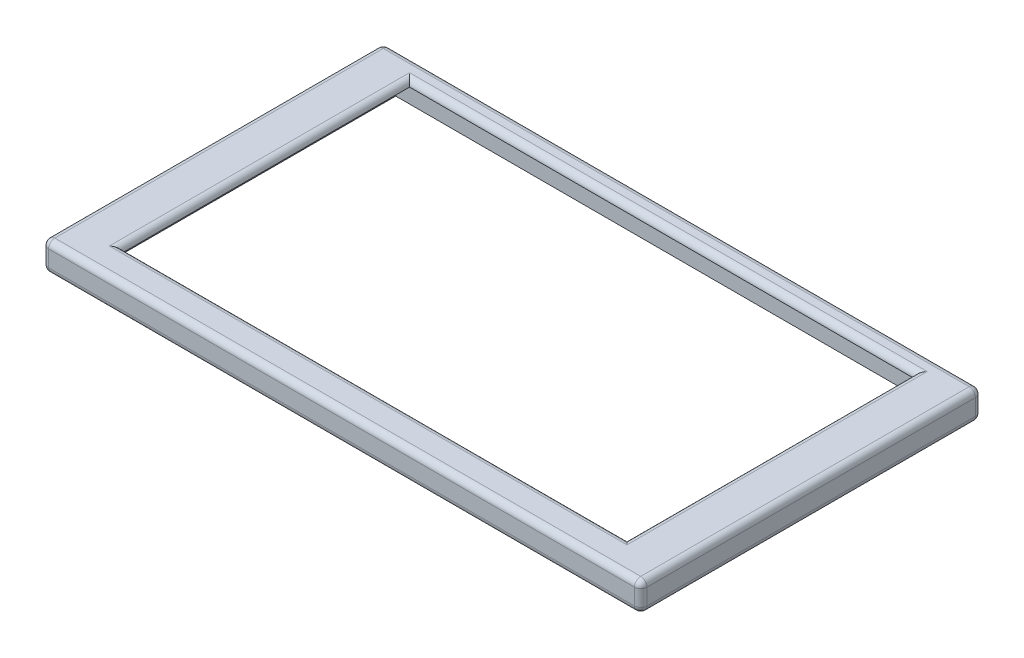
ISO-10303-21;
HEADER;
FILE_DESCRIPTION(('STEP AP214'),'2;1');
FILE_NAME('part.step','',(''),(''),'','','');
FILE_SCHEMA(('AUTOMOTIVE_DESIGN { 1 0 10303 214 1 1 1 1 }'));
ENDSEC;
DATA;
#1=APPLICATION_CONTEXT('core data for automotive mechanical design processes');
#2=APPLICATION_PROTOCOL_DEFINITION('international standard','automotive_design',2000,#1);
#3=PRODUCT_CONTEXT('',#1,'mechanical');
#4=PRODUCT('Part','Part','',(#3));
#5=PRODUCT_RELATED_PRODUCT_CATEGORY('part','',(#4));
#6=PRODUCT_DEFINITION_FORMATION('','',#4);
#7=PRODUCT_DEFINITION_CONTEXT('part definition',#1,'design');
#8=PRODUCT_DEFINITION('design','',#6,#7);
#9=PRODUCT_DEFINITION_SHAPE('','',#8);
#10=(LENGTH_UNIT() NAMED_UNIT(*) SI_UNIT(.MILLI.,.METRE.));
#11=(NAMED_UNIT(*) PLANE_ANGLE_UNIT() SI_UNIT($,.RADIAN.));
#12=(NAMED_UNIT(*) SI_UNIT($,.STERADIAN.) SOLID_ANGLE_UNIT());
#13=UNCERTAINTY_MEASURE_WITH_UNIT(LENGTH_MEASURE(1.E-05),#10,'distance_accuracy_value','');
#14=(GEOMETRIC_REPRESENTATION_CONTEXT(3) GLOBAL_UNCERTAINTY_ASSIGNED_CONTEXT((#13)) GLOBAL_UNIT_ASSIGNED_CONTEXT((#10,
#11,#12)) REPRESENTATION_CONTEXT('',''));
#15=CARTESIAN_POINT('',(0.,0.,0.));
#16=DIRECTION('',(0.,0.,1.));
#17=DIRECTION('',(1.,0.,0.));
#18=AXIS2_PLACEMENT_3D('',#15,#16,#17);
#19=CARTESIAN_POINT('',(0.,9.2,0.));
#20=DIRECTION('',(0.,-1.,0.));
#21=DIRECTION('',(0.,0.,-1.));
#22=AXIS2_PLACEMENT_3D('',#19,#20,#21);
#23=PLANE('',#22);
#24=DIRECTION('',(1.,0.,0.));
#25=VECTOR('',#24,1.);
#26=CARTESIAN_POINT('',(14.9,9.2,-8.5));
#27=LINE('',#26,#25);
#28=CARTESIAN_POINT('',(178.4,9.2,-8.5));
#29=VERTEX_POINT('',#28);
#30=CARTESIAN_POINT('',(12.9,9.2,-8.5));
#31=VERTEX_POINT('',#30);
#32=EDGE_CURVE('E44',#29,#31,#27,.F.);
#33=ORIENTED_EDGE('',*,*,#32,.T.);
#34=DIRECTION('',(0.,0.,1.));
#35=VECTOR('',#34,1.);
#36=CARTESIAN_POINT('',(12.9,9.2,-102.5));
#37=LINE('',#36,#35);
#38=CARTESIAN_POINT('',(12.9,9.2,-104.5));
#39=VERTEX_POINT('',#38);
#40=EDGE_CURVE('E12',#31,#39,#37,.F.);
#41=ORIENTED_EDGE('',*,*,#40,.T.);
#42=DIRECTION('',(-1.,0.,0.));
#43=VECTOR('',#42,1.);
#44=CARTESIAN_POINT('',(176.4,9.2,-104.5));
#45=LINE('',#44,#43);
#46=CARTESIAN_POINT('',(178.4,9.2,-104.5));
#47=VERTEX_POINT('',#46);
#48=EDGE_CURVE('E339',#39,#47,#45,.F.);
#49=ORIENTED_EDGE('',*,*,#48,.T.);
#50=DIRECTION('',(0.,0.,-1.));
#51=VECTOR('',#50,1.);
#52=CARTESIAN_POINT('',(178.4,9.2,-10.5));
#53=LINE('',#52,#51);
#54=EDGE_CURVE('E55',#47,#29,#53,.F.);
#55=ORIENTED_EDGE('',*,*,#54,.T.);
#56=EDGE_LOOP('',(#33,#41,#49,#55));
#57=FACE_BOUND('',#56,.T.);
#58=DIRECTION('',(0.,0.,-1.));
#59=VECTOR('',#58,1.);
#60=CARTESIAN_POINT('',(189.3,9.2,0.));
#61=LINE('',#60,#59);
#62=CARTESIAN_POINT('',(189.3,9.2,-2.));
#63=VERTEX_POINT('',#62);
#64=CARTESIAN_POINT('',(189.3,9.2,-107.));
#65=VERTEX_POINT('',#64);
#66=EDGE_CURVE('E334',#63,#65,#61,.T.);
#67=ORIENTED_EDGE('',*,*,#66,.T.);
#68=DIRECTION('',(-1.,0.,0.));
#69=VECTOR('',#68,1.);
#70=CARTESIAN_POINT('',(0.,9.2,-107.));
#71=LINE('',#70,#69);
#72=CARTESIAN_POINT('',(2.,9.2,-107.));
#73=VERTEX_POINT('',#72);
#74=EDGE_CURVE('E336',#65,#73,#71,.T.);
#75=ORIENTED_EDGE('',*,*,#74,.T.);
#76=DIRECTION('',(0.,0.,1.));
#77=VECTOR('',#76,1.);
#78=CARTESIAN_POINT('',(2.,9.2,0.));
#79=LINE('',#78,#77);
#80=CARTESIAN_POINT('',(2.,9.2,-2.));
#81=VERTEX_POINT('',#80);
#82=EDGE_CURVE('E330',#73,#81,#79,.T.);
#83=ORIENTED_EDGE('',*,*,#82,.T.);
#84=DIRECTION('',(1.,0.,0.));
#85=VECTOR('',#84,1.);
#86=CARTESIAN_POINT('',(0.,9.2,-2.));
#87=LINE('',#86,#85);
#88=EDGE_CURVE('E332',#81,#63,#87,.T.);
#89=ORIENTED_EDGE('',*,*,#88,.T.);
#90=EDGE_LOOP('',(#67,#75,#83,#89));
#91=FACE_BOUND('',#90,.T.);
#92=ADVANCED_FACE('F35',(#57,#91),#23,.F.);
#93=CARTESIAN_POINT('',(0.,0.,0.));
#94=DIRECTION('',(0.,-1.,0.));
#95=DIRECTION('',(0.,0.,-1.));
#96=AXIS2_PLACEMENT_3D('',#93,#94,#95);
#97=PLANE('',#96);
#98=DIRECTION('',(1.,0.,0.));
#99=VECTOR('',#98,1.);
#100=CARTESIAN_POINT('',(0.,0.,-2.));
#101=LINE('',#100,#99);
#102=CARTESIAN_POINT('',(189.3,0.,-2.));
#103=VERTEX_POINT('',#102);
#104=CARTESIAN_POINT('',(2.,0.,-2.));
#105=VERTEX_POINT('',#104);
#106=EDGE_CURVE('E292',#103,#105,#101,.F.);
#107=ORIENTED_EDGE('',*,*,#106,.T.);
#108=DIRECTION('',(0.,0.,1.));
#109=VECTOR('',#108,1.);
#110=CARTESIAN_POINT('',(2.,0.,-109.));
#111=LINE('',#110,#109);
#112=CARTESIAN_POINT('',(2.,0.,-28.));
#113=VERTEX_POINT('',#112);
#114=EDGE_CURVE('E300',#105,#113,#111,.F.);
#115=ORIENTED_EDGE('',*,*,#114,.T.);
#116=DIRECTION('',(-1.,0.,0.));
#117=VECTOR('',#116,1.);
#118=CARTESIAN_POINT('',(2.,0.,-28.));
#119=LINE('',#118,#117);
#120=CARTESIAN_POINT('',(6.,0.,-28.));
#121=VERTEX_POINT('',#120);
#122=EDGE_CURVE('E220',#121,#113,#119,.T.);
#123=ORIENTED_EDGE('',*,*,#122,.F.);
#124=DIRECTION('',(0.,0.,1.));
#125=VECTOR('',#124,1.);
#126=CARTESIAN_POINT('',(6.,0.,-81.));
#127=LINE('',#126,#125);
#128=CARTESIAN_POINT('',(6.,0.,-81.));
#129=VERTEX_POINT('',#128);
#130=EDGE_CURVE('E223',#129,#121,#127,.T.);
#131=ORIENTED_EDGE('',*,*,#130,.F.);
#132=DIRECTION('',(1.,0.,0.));
#133=VECTOR('',#132,1.);
#134=CARTESIAN_POINT('',(2.,0.,-81.));
#135=LINE('',#134,#133);
#136=CARTESIAN_POINT('',(2.,0.,-81.));
#137=VERTEX_POINT('',#136);
#138=EDGE_CURVE('E229',#137,#129,#135,.T.);
#139=ORIENTED_EDGE('',*,*,#138,.F.);
#140=DIRECTION('',(0.,0.,1.));
#141=VECTOR('',#140,1.);
#142=CARTESIAN_POINT('',(2.,0.,-109.));
#143=LINE('',#142,#141);
#144=CARTESIAN_POINT('',(2.,0.,-107.));
#145=VERTEX_POINT('',#144);
#146=EDGE_CURVE('E298',#137,#145,#143,.F.);
#147=ORIENTED_EDGE('',*,*,#146,.T.);
#148=DIRECTION('',(-1.,0.,0.));
#149=VECTOR('',#148,1.);
#150=CARTESIAN_POINT('',(191.3,0.,-107.));
#151=LINE('',#150,#149);
#152=CARTESIAN_POINT('',(189.3,0.,-107.));
#153=VERTEX_POINT('',#152);
#154=EDGE_CURVE('E296',#145,#153,#151,.F.);
#155=ORIENTED_EDGE('',*,*,#154,.T.);
#156=DIRECTION('',(0.,0.,-1.));
#157=VECTOR('',#156,1.);
#158=CARTESIAN_POINT('',(189.3,0.,0.));
#159=LINE('',#158,#157);
#160=EDGE_CURVE('E294',#153,#103,#159,.F.);
#161=ORIENTED_EDGE('',*,*,#160,.T.);
#162=EDGE_LOOP('',(#107,#115,#123,#131,#139,#147,#155,#161));
#163=FACE_BOUND('',#162,.T.);
#164=DIRECTION('',(0.,0.,-1.));
#165=VECTOR('',#164,1.);
#166=CARTESIAN_POINT('',(8.,0.,-105.));
#167=LINE('',#166,#165);
#168=CARTESIAN_POINT('',(8.,0.,-4.));
#169=VERTEX_POINT('',#168);
#170=CARTESIAN_POINT('',(8.,0.,-105.));
#171=VERTEX_POINT('',#170);
#172=EDGE_CURVE('E251',#169,#171,#167,.T.);
#173=ORIENTED_EDGE('',*,*,#172,.F.);
#174=DIRECTION('',(-1.,0.,0.));
#175=VECTOR('',#174,1.);
#176=CARTESIAN_POINT('',(8.,0.,-4.));
#177=LINE('',#176,#175);
#178=CARTESIAN_POINT('',(183.3,0.,-4.));
#179=VERTEX_POINT('',#178);
#180=EDGE_CURVE('E256',#179,#169,#177,.T.);
#181=ORIENTED_EDGE('',*,*,#180,.F.);
#182=DIRECTION('',(0.,0.,1.));
#183=VECTOR('',#182,1.);
#184=CARTESIAN_POINT('',(183.3,0.,-4.));
#185=LINE('',#184,#183);
#186=CARTESIAN_POINT('',(183.3,0.,-105.));
#187=VERTEX_POINT('',#186);
#188=EDGE_CURVE('E270',#187,#179,#185,.T.);
#189=ORIENTED_EDGE('',*,*,#188,.F.);
#190=DIRECTION('',(1.,0.,0.));
#191=VECTOR('',#190,1.);
#192=CARTESIAN_POINT('',(183.3,0.,-105.));
#193=LINE('',#192,#191);
#194=EDGE_CURVE('E267',#171,#187,#193,.T.);
#195=ORIENTED_EDGE('',*,*,#194,.F.);
#196=EDGE_LOOP('',(#173,#181,#189,#195));
#197=FACE_BOUND('',#196,.T.);
#198=ADVANCED_FACE('F429',(#163,#197),#97,.T.);
#199=CARTESIAN_POINT('',(0.,9.2,0.));
#200=DIRECTION('',(1.,0.,0.));
#201=DIRECTION('',(0.,0.,-1.));
#202=AXIS2_PLACEMENT_3D('',#199,#200,#201);
#203=PLANE('',#202);
#204=DIRECTION('',(0.,-1.,0.));
#205=VECTOR('',#204,1.);
#206=CARTESIAN_POINT('',(0.,9.2,-107.));
#207=LINE('',#206,#205);
#208=CARTESIAN_POINT('',(0.,7.2,-107.));
#209=VERTEX_POINT('',#208);
#210=CARTESIAN_POINT('',(0.,2.,-107.));
#211=VERTEX_POINT('',#210);
#212=EDGE_CURVE('E287',#209,#211,#207,.T.);
#213=ORIENTED_EDGE('',*,*,#212,.T.);
#214=DIRECTION('',(0.,0.,1.));
#215=VECTOR('',#214,1.);
#216=CARTESIAN_POINT('',(0.,2.,0.));
#217=LINE('',#216,#215);
#218=CARTESIAN_POINT('',(0.,2.,-2.));
#219=VERTEX_POINT('',#218);
#220=EDGE_CURVE('E289',#211,#219,#217,.T.);
#221=ORIENTED_EDGE('',*,*,#220,.T.);
#222=DIRECTION('',(0.,-1.,0.));
#223=VECTOR('',#222,1.);
#224=CARTESIAN_POINT('',(0.,9.2,-2.));
#225=LINE('',#224,#223);
#226=CARTESIAN_POINT('',(0.,7.2,-2.));
#227=VERTEX_POINT('',#226);
#228=EDGE_CURVE('E285',#219,#227,#225,.F.);
#229=ORIENTED_EDGE('',*,*,#228,.T.);
#230=DIRECTION('',(0.,0.,1.));
#231=VECTOR('',#230,1.);
#232=CARTESIAN_POINT('',(0.,7.2,0.));
#233=LINE('',#232,#231);
#234=EDGE_CURVE('E277',#227,#209,#233,.F.);
#235=ORIENTED_EDGE('',*,*,#234,.T.);
#236=EDGE_LOOP('',(#213,#221,#229,#235));
#237=FACE_BOUND('',#236,.T.);
#238=ADVANCED_FACE('F508',(#237),#203,.F.);
#239=CARTESIAN_POINT('',(0.,9.2,0.));
#240=DIRECTION('',(0.,0.,-1.));
#241=DIRECTION('',(-1.,0.,0.));
#242=AXIS2_PLACEMENT_3D('',#239,#240,#241);
#243=PLANE('',#242);
#244=DIRECTION('',(0.,-1.,0.));
#245=VECTOR('',#244,1.);
#246=CARTESIAN_POINT('',(2.,9.2,0.));
#247=LINE('',#246,#245);
#248=CARTESIAN_POINT('',(2.,7.2,0.));
#249=VERTEX_POINT('',#248);
#250=CARTESIAN_POINT('',(2.,2.,0.));
#251=VERTEX_POINT('',#250);
#252=EDGE_CURVE('E325',#249,#251,#247,.T.);
#253=ORIENTED_EDGE('',*,*,#252,.T.);
#254=DIRECTION('',(1.,0.,0.));
#255=VECTOR('',#254,1.);
#256=CARTESIAN_POINT('',(191.3,2.,0.));
#257=LINE('',#256,#255);
#258=CARTESIAN_POINT('',(189.3,2.,0.));
#259=VERTEX_POINT('',#258);
#260=EDGE_CURVE('E328',#251,#259,#257,.T.);
#261=ORIENTED_EDGE('',*,*,#260,.T.);
#262=DIRECTION('',(0.,-1.,0.));
#263=VECTOR('',#262,1.);
#264=CARTESIAN_POINT('',(189.3,9.2,0.));
#265=LINE('',#264,#263);
#266=CARTESIAN_POINT('',(189.3,7.2,0.));
#267=VERTEX_POINT('',#266);
#268=EDGE_CURVE('E323',#259,#267,#265,.F.);
#269=ORIENTED_EDGE('',*,*,#268,.T.);
#270=DIRECTION('',(1.,0.,0.));
#271=VECTOR('',#270,1.);
#272=CARTESIAN_POINT('',(0.,7.2,0.));
#273=LINE('',#272,#271);
#274=EDGE_CURVE('E321',#267,#249,#273,.F.);
#275=ORIENTED_EDGE('',*,*,#274,.T.);
#276=EDGE_LOOP('',(#253,#261,#269,#275));
#277=FACE_BOUND('',#276,.T.);
#278=ADVANCED_FACE('F518',(#277),#243,.F.);
#279=CARTESIAN_POINT('',(191.3,9.2,0.));
#280=DIRECTION('',(-1.,0.,0.));
#281=DIRECTION('',(0.,0.,1.));
#282=AXIS2_PLACEMENT_3D('',#279,#280,#281);
#283=PLANE('',#282);
#284=DIRECTION('',(0.,0.,-1.));
#285=VECTOR('',#284,1.);
#286=CARTESIAN_POINT('',(191.3,2.,-109.));
#287=LINE('',#286,#285);
#288=CARTESIAN_POINT('',(191.3,2.,-2.));
#289=VERTEX_POINT('',#288);
#290=CARTESIAN_POINT('',(191.3,2.,-107.));
#291=VERTEX_POINT('',#290);
#292=EDGE_CURVE('E316',#289,#291,#287,.T.);
#293=ORIENTED_EDGE('',*,*,#292,.T.);
#294=DIRECTION('',(0.,-1.,0.));
#295=VECTOR('',#294,1.);
#296=CARTESIAN_POINT('',(191.3,9.2,-107.));
#297=LINE('',#296,#295);
#298=CARTESIAN_POINT('',(191.3,7.2,-107.));
#299=VERTEX_POINT('',#298);
#300=EDGE_CURVE('E318',#291,#299,#297,.F.);
#301=ORIENTED_EDGE('',*,*,#300,.T.);
#302=DIRECTION('',(0.,0.,-1.));
#303=VECTOR('',#302,1.);
#304=CARTESIAN_POINT('',(191.3,7.2,0.));
#305=LINE('',#304,#303);
#306=CARTESIAN_POINT('',(191.3,7.2,-2.));
#307=VERTEX_POINT('',#306);
#308=EDGE_CURVE('E312',#299,#307,#305,.F.);
#309=ORIENTED_EDGE('',*,*,#308,.T.);
#310=DIRECTION('',(0.,-1.,0.));
#311=VECTOR('',#310,1.);
#312=CARTESIAN_POINT('',(191.3,9.2,-2.));
#313=LINE('',#312,#311);
#314=EDGE_CURVE('E314',#307,#289,#313,.T.);
#315=ORIENTED_EDGE('',*,*,#314,.T.);
#316=EDGE_LOOP('',(#293,#301,#309,#315));
#317=FACE_BOUND('',#316,.T.);
#318=ADVANCED_FACE('F472',(#317),#283,.F.);
#319=CARTESIAN_POINT('',(0.,9.2,-109.));
#320=DIRECTION('',(0.,0.,1.));
#321=DIRECTION('',(1.,0.,0.));
#322=AXIS2_PLACEMENT_3D('',#319,#320,#321);
#323=PLANE('',#322);
#324=DIRECTION('',(-1.,0.,0.));
#325=VECTOR('',#324,1.);
#326=CARTESIAN_POINT('',(0.,2.,-109.));
#327=LINE('',#326,#325);
#328=CARTESIAN_POINT('',(189.3,2.,-109.));
#329=VERTEX_POINT('',#328);
#330=CARTESIAN_POINT('',(2.,2.,-109.));
#331=VERTEX_POINT('',#330);
#332=EDGE_CURVE('E307',#329,#331,#327,.T.);
#333=ORIENTED_EDGE('',*,*,#332,.T.);
#334=DIRECTION('',(0.,-1.,0.));
#335=VECTOR('',#334,1.);
#336=CARTESIAN_POINT('',(2.,9.2,-109.));
#337=LINE('',#336,#335);
#338=CARTESIAN_POINT('',(2.,7.2,-109.));
#339=VERTEX_POINT('',#338);
#340=EDGE_CURVE('E309',#331,#339,#337,.F.);
#341=ORIENTED_EDGE('',*,*,#340,.T.);
#342=DIRECTION('',(-1.,0.,0.));
#343=VECTOR('',#342,1.);
#344=CARTESIAN_POINT('',(0.,7.2,-109.));
#345=LINE('',#344,#343);
#346=CARTESIAN_POINT('',(189.3,7.2,-109.));
#347=VERTEX_POINT('',#346);
#348=EDGE_CURVE('E303',#339,#347,#345,.F.);
#349=ORIENTED_EDGE('',*,*,#348,.T.);
#350=DIRECTION('',(0.,-1.,0.));
#351=VECTOR('',#350,1.);
#352=CARTESIAN_POINT('',(189.3,9.2,-109.));
#353=LINE('',#352,#351);
#354=EDGE_CURVE('E305',#347,#329,#353,.T.);
#355=ORIENTED_EDGE('',*,*,#354,.T.);
#356=EDGE_LOOP('',(#333,#341,#349,#355));
#357=FACE_BOUND('',#356,.T.);
#358=ADVANCED_FACE('F488',(#357),#323,.F.);
#359=CARTESIAN_POINT('',(8.,7.2,-105.));
#360=DIRECTION('',(-1.,0.,0.));
#361=DIRECTION('',(0.,0.,1.));
#362=AXIS2_PLACEMENT_3D('',#359,#360,#361);
#363=PLANE('',#362);
#364=ORIENTED_EDGE('',*,*,#172,.T.);
#365=DIRECTION('',(0.,-1.,0.));
#366=VECTOR('',#365,1.);
#367=CARTESIAN_POINT('',(8.,7.2,-105.));
#368=LINE('',#367,#366);
#369=CARTESIAN_POINT('',(8.,7.2,-105.));
#370=VERTEX_POINT('',#369);
#371=EDGE_CURVE('E265',#370,#171,#368,.T.);
#372=ORIENTED_EDGE('',*,*,#371,.F.);
#373=DIRECTION('',(0.,0.,-1.));
#374=VECTOR('',#373,1.);
#375=CARTESIAN_POINT('',(8.,7.2,-105.));
#376=LINE('',#375,#374);
#377=CARTESIAN_POINT('',(8.,7.2,-4.));
#378=VERTEX_POINT('',#377);
#379=EDGE_CURVE('E252',#378,#370,#376,.T.);
#380=ORIENTED_EDGE('',*,*,#379,.F.);
#381=DIRECTION('',(0.,-1.,0.));
#382=VECTOR('',#381,1.);
#383=CARTESIAN_POINT('',(8.,7.2,-4.));
#384=LINE('',#383,#382);
#385=EDGE_CURVE('E275',#378,#169,#384,.T.);
#386=ORIENTED_EDGE('',*,*,#385,.T.);
#387=EDGE_LOOP('',(#364,#372,#380,#386));
#388=FACE_BOUND('',#387,.T.);
#389=ADVANCED_FACE('F754',(#388),#363,.F.);
#390=CARTESIAN_POINT('',(8.,7.2,-4.));
#391=DIRECTION('',(0.,0.,1.));
#392=DIRECTION('',(1.,0.,0.));
#393=AXIS2_PLACEMENT_3D('',#390,#391,#392);
#394=PLANE('',#393);
#395=ORIENTED_EDGE('',*,*,#180,.T.);
#396=ORIENTED_EDGE('',*,*,#385,.F.);
#397=DIRECTION('',(-1.,0.,0.));
#398=VECTOR('',#397,1.);
#399=CARTESIAN_POINT('',(8.,7.2,-4.));
#400=LINE('',#399,#398);
#401=CARTESIAN_POINT('',(183.3,7.2,-4.));
#402=VERTEX_POINT('',#401);
#403=EDGE_CURVE('E262',#402,#378,#400,.T.);
#404=ORIENTED_EDGE('',*,*,#403,.F.);
#405=DIRECTION('',(0.,-1.,0.));
#406=VECTOR('',#405,1.);
#407=CARTESIAN_POINT('',(183.3,7.2,-4.));
#408=LINE('',#407,#406);
#409=EDGE_CURVE('E278',#402,#179,#408,.T.);
#410=ORIENTED_EDGE('',*,*,#409,.T.);
#411=EDGE_LOOP('',(#395,#396,#404,#410));
#412=FACE_BOUND('',#411,.T.);
#413=ADVANCED_FACE('F823',(#412),#394,.F.);
#414=CARTESIAN_POINT('',(183.3,7.2,-4.));
#415=DIRECTION('',(1.,0.,0.));
#416=DIRECTION('',(0.,0.,-1.));
#417=AXIS2_PLACEMENT_3D('',#414,#415,#416);
#418=PLANE('',#417);
#419=ORIENTED_EDGE('',*,*,#188,.T.);
#420=ORIENTED_EDGE('',*,*,#409,.F.);
#421=DIRECTION('',(0.,0.,1.));
#422=VECTOR('',#421,1.);
#423=CARTESIAN_POINT('',(183.3,7.2,-4.));
#424=LINE('',#423,#422);
#425=CARTESIAN_POINT('',(183.3,7.2,-105.));
#426=VERTEX_POINT('',#425);
#427=EDGE_CURVE('E259',#426,#402,#424,.T.);
#428=ORIENTED_EDGE('',*,*,#427,.F.);
#429=DIRECTION('',(0.,-1.,0.));
#430=VECTOR('',#429,1.);
#431=CARTESIAN_POINT('',(183.3,7.2,-105.));
#432=LINE('',#431,#430);
#433=EDGE_CURVE('E280',#426,#187,#432,.T.);
#434=ORIENTED_EDGE('',*,*,#433,.T.);
#435=EDGE_LOOP('',(#419,#420,#428,#434));
#436=FACE_BOUND('',#435,.T.);
#437=ADVANCED_FACE('F813',(#436),#418,.F.);
#438=CARTESIAN_POINT('',(183.3,7.2,-105.));
#439=DIRECTION('',(0.,0.,-1.));
#440=DIRECTION('',(-1.,0.,0.));
#441=AXIS2_PLACEMENT_3D('',#438,#439,#440);
#442=PLANE('',#441);
#443=ORIENTED_EDGE('',*,*,#194,.T.);
#444=ORIENTED_EDGE('',*,*,#433,.F.);
#445=DIRECTION('',(1.,0.,0.));
#446=VECTOR('',#445,1.);
#447=CARTESIAN_POINT('',(183.3,7.2,-105.));
#448=LINE('',#447,#446);
#449=EDGE_CURVE('E255',#370,#426,#448,.T.);
#450=ORIENTED_EDGE('',*,*,#449,.F.);
#451=ORIENTED_EDGE('',*,*,#371,.T.);
#452=EDGE_LOOP('',(#443,#444,#450,#451));
#453=FACE_BOUND('',#452,.T.);
#454=ADVANCED_FACE('F742',(#453),#442,.F.);
#455=CARTESIAN_POINT('',(0.,7.2,0.));
#456=DIRECTION('',(0.,1.,0.));
#457=DIRECTION('',(0.,0.,1.));
#458=AXIS2_PLACEMENT_3D('',#455,#456,#457);
#459=PLANE('',#458);
#460=DIRECTION('',(0.,0.,-1.));
#461=VECTOR('',#460,1.);
#462=CARTESIAN_POINT('',(14.9,7.2,-10.5));
#463=LINE('',#462,#461);
#464=CARTESIAN_POINT('',(14.9,7.2,-10.5));
#465=VERTEX_POINT('',#464);
#466=CARTESIAN_POINT('',(14.9,7.2,-102.5));
#467=VERTEX_POINT('',#466);
#468=EDGE_CURVE('E236',#465,#467,#463,.T.);
#469=ORIENTED_EDGE('',*,*,#468,.F.);
#470=DIRECTION('',(-1.,0.,0.));
#471=VECTOR('',#470,1.);
#472=CARTESIAN_POINT('',(14.9,7.2,-10.5));
#473=LINE('',#472,#471);
#474=CARTESIAN_POINT('',(176.4,7.2,-10.5));
#475=VERTEX_POINT('',#474);
#476=EDGE_CURVE('E248',#475,#465,#473,.T.);
#477=ORIENTED_EDGE('',*,*,#476,.F.);
#478=DIRECTION('',(0.,0.,1.));
#479=VECTOR('',#478,1.);
#480=CARTESIAN_POINT('',(176.4,7.2,-10.5));
#481=LINE('',#480,#479);
#482=CARTESIAN_POINT('',(176.4,7.2,-102.5));
#483=VERTEX_POINT('',#482);
#484=EDGE_CURVE('E245',#483,#475,#481,.T.);
#485=ORIENTED_EDGE('',*,*,#484,.F.);
#486=DIRECTION('',(1.,0.,0.));
#487=VECTOR('',#486,1.);
#488=CARTESIAN_POINT('',(14.9,7.2,-102.5));
#489=LINE('',#488,#487);
#490=EDGE_CURVE('E242',#467,#483,#489,.T.);
#491=ORIENTED_EDGE('',*,*,#490,.F.);
#492=EDGE_LOOP('',(#469,#477,#485,#491));
#493=FACE_BOUND('',#492,.T.);
#494=ORIENTED_EDGE('',*,*,#379,.T.);
#495=ORIENTED_EDGE('',*,*,#449,.T.);
#496=ORIENTED_EDGE('',*,*,#427,.T.);
#497=ORIENTED_EDGE('',*,*,#403,.T.);
#498=EDGE_LOOP('',(#494,#495,#496,#497));
#499=FACE_BOUND('',#498,.T.);
#500=ADVANCED_FACE('F733',(#493,#499),#459,.F.);
#501=CARTESIAN_POINT('',(2.,3.,-81.));
#502=DIRECTION('',(-1.,0.,0.));
#503=DIRECTION('',(0.,0.,1.));
#504=AXIS2_PLACEMENT_3D('',#501,#502,#503);
#505=PLANE('',#504);
#506=DIRECTION('',(0.,0.,-1.));
#507=VECTOR('',#506,1.);
#508=CARTESIAN_POINT('',(2.,0.,-81.));
#509=LINE('',#508,#507);
#510=EDGE_CURVE('E203',#113,#137,#509,.T.);
#511=ORIENTED_EDGE('',*,*,#510,.T.);
#512=DIRECTION('',(0.,-1.,0.));
#513=VECTOR('',#512,1.);
#514=CARTESIAN_POINT('',(2.,3.,-81.));
#515=LINE('',#514,#513);
#516=CARTESIAN_POINT('',(2.,3.,-81.));
#517=VERTEX_POINT('',#516);
#518=EDGE_CURVE('E196',#517,#137,#515,.T.);
#519=ORIENTED_EDGE('',*,*,#518,.F.);
#520=DIRECTION('',(0.,0.,-1.));
#521=VECTOR('',#520,1.);
#522=CARTESIAN_POINT('',(2.,3.,-81.));
#523=LINE('',#522,#521);
#524=CARTESIAN_POINT('',(2.,3.,-28.));
#525=VERTEX_POINT('',#524);
#526=EDGE_CURVE('E201',#525,#517,#523,.T.);
#527=ORIENTED_EDGE('',*,*,#526,.F.);
#528=DIRECTION('',(0.,-1.,0.));
#529=VECTOR('',#528,1.);
#530=CARTESIAN_POINT('',(2.,3.,-28.));
#531=LINE('',#530,#529);
#532=EDGE_CURVE('E234',#525,#113,#531,.T.);
#533=ORIENTED_EDGE('',*,*,#532,.T.);
#534=EDGE_LOOP('',(#511,#519,#527,#533));
#535=FACE_BOUND('',#534,.T.);
#536=ADVANCED_FACE('F198',(#535),#505,.F.);
#537=CARTESIAN_POINT('',(2.,3.,-28.));
#538=DIRECTION('',(0.,0.,1.));
#539=DIRECTION('',(1.,0.,0.));
#540=AXIS2_PLACEMENT_3D('',#537,#538,#539);
#541=PLANE('',#540);
#542=ORIENTED_EDGE('',*,*,#122,.T.);
#543=ORIENTED_EDGE('',*,*,#532,.F.);
#544=DIRECTION('',(-1.,0.,0.));
#545=VECTOR('',#544,1.);
#546=CARTESIAN_POINT('',(2.,3.,-28.));
#547=LINE('',#546,#545);
#548=CARTESIAN_POINT('',(6.,3.,-28.));
#549=VERTEX_POINT('',#548);
#550=EDGE_CURVE('E208',#549,#525,#547,.T.);
#551=ORIENTED_EDGE('',*,*,#550,.F.);
#552=DIRECTION('',(0.,-1.,0.));
#553=VECTOR('',#552,1.);
#554=CARTESIAN_POINT('',(6.,3.,-28.));
#555=LINE('',#554,#553);
#556=EDGE_CURVE('E237',#549,#121,#555,.T.);
#557=ORIENTED_EDGE('',*,*,#556,.T.);
#558=EDGE_LOOP('',(#542,#543,#551,#557));
#559=FACE_BOUND('',#558,.T.);
#560=ADVANCED_FACE('F719',(#559),#541,.F.);
#561=CARTESIAN_POINT('',(6.,3.,-81.));
#562=DIRECTION('',(1.,0.,0.));
#563=DIRECTION('',(0.,0.,-1.));
#564=AXIS2_PLACEMENT_3D('',#561,#562,#563);
#565=PLANE('',#564);
#566=ORIENTED_EDGE('',*,*,#130,.T.);
#567=ORIENTED_EDGE('',*,*,#556,.F.);
#568=DIRECTION('',(0.,0.,1.));
#569=VECTOR('',#568,1.);
#570=CARTESIAN_POINT('',(6.,3.,-81.));
#571=LINE('',#570,#569);
#572=CARTESIAN_POINT('',(6.,3.,-81.));
#573=VERTEX_POINT('',#572);
#574=EDGE_CURVE('E216',#573,#549,#571,.T.);
#575=ORIENTED_EDGE('',*,*,#574,.F.);
#576=DIRECTION('',(0.,-1.,0.));
#577=VECTOR('',#576,1.);
#578=CARTESIAN_POINT('',(6.,3.,-81.));
#579=LINE('',#578,#577);
#580=EDGE_CURVE('E207',#573,#129,#579,.T.);
#581=ORIENTED_EDGE('',*,*,#580,.T.);
#582=EDGE_LOOP('',(#566,#567,#575,#581));
#583=FACE_BOUND('',#582,.T.);
#584=ADVANCED_FACE('F712',(#583),#565,.F.);
#585=CARTESIAN_POINT('',(2.,3.,-81.));
#586=DIRECTION('',(0.,0.,-1.));
#587=DIRECTION('',(-1.,0.,0.));
#588=AXIS2_PLACEMENT_3D('',#585,#586,#587);
#589=PLANE('',#588);
#590=ORIENTED_EDGE('',*,*,#138,.T.);
#591=ORIENTED_EDGE('',*,*,#580,.F.);
#592=DIRECTION('',(1.,0.,0.));
#593=VECTOR('',#592,1.);
#594=CARTESIAN_POINT('',(2.,3.,-81.));
#595=LINE('',#594,#593);
#596=EDGE_CURVE('E211',#517,#573,#595,.T.);
#597=ORIENTED_EDGE('',*,*,#596,.F.);
#598=ORIENTED_EDGE('',*,*,#518,.T.);
#599=EDGE_LOOP('',(#590,#591,#597,#598));
#600=FACE_BOUND('',#599,.T.);
#601=ADVANCED_FACE('F212',(#600),#589,.F.);
#602=CARTESIAN_POINT('',(0.,3.,0.));
#603=DIRECTION('',(0.,1.,0.));
#604=DIRECTION('',(0.,0.,1.));
#605=AXIS2_PLACEMENT_3D('',#602,#603,#604);
#606=PLANE('',#605);
#607=ORIENTED_EDGE('',*,*,#526,.T.);
#608=ORIENTED_EDGE('',*,*,#596,.T.);
#609=ORIENTED_EDGE('',*,*,#574,.T.);
#610=ORIENTED_EDGE('',*,*,#550,.T.);
#611=EDGE_LOOP('',(#607,#608,#609,#610));
#612=FACE_BOUND('',#611,.T.);
#613=ADVANCED_FACE('F218',(#612),#606,.F.);
#614=CARTESIAN_POINT('',(189.3,7.2,0.));
#615=DIRECTION('',(0.,0.,-1.));
#616=DIRECTION('',(-1.,0.,0.));
#617=AXIS2_PLACEMENT_3D('',#614,#615,#616);
#618=CYLINDRICAL_SURFACE('',#617,2.);
#619=CARTESIAN_POINT('',(189.3,7.2,-107.));
#620=DIRECTION('',(0.,0.,-1.));
#621=DIRECTION('',(-1.,0.,0.));
#622=AXIS2_PLACEMENT_3D('',#619,#620,#621);
#623=CIRCLE('',#622,2.);
#624=EDGE_CURVE('E230',#65,#299,#623,.T.);
#625=ORIENTED_EDGE('',*,*,#624,.F.);
#626=ORIENTED_EDGE('',*,*,#66,.F.);
#627=CARTESIAN_POINT('',(189.3,7.2,-2.));
#628=DIRECTION('',(0.,0.,1.));
#629=DIRECTION('',(1.,0.,0.));
#630=AXIS2_PLACEMENT_3D('',#627,#628,#629);
#631=CIRCLE('',#630,2.);
#632=EDGE_CURVE('E404',#307,#63,#631,.T.);
#633=ORIENTED_EDGE('',*,*,#632,.F.);
#634=ORIENTED_EDGE('',*,*,#308,.F.);
#635=EDGE_LOOP('',(#625,#626,#633,#634));
#636=FACE_BOUND('',#635,.T.);
#637=ADVANCED_FACE('F439',(#636),#618,.T.);
#638=CARTESIAN_POINT('',(189.3,7.2,-107.));
#639=DIRECTION('',(0.,0.,1.));
#640=DIRECTION('',(1.,0.,0.));
#641=AXIS2_PLACEMENT_3D('',#638,#639,#640);
#642=SPHERICAL_SURFACE('',#641,2.);
#643=CARTESIAN_POINT('',(189.3,7.2,-107.));
#644=DIRECTION('',(1.,0.,0.));
#645=DIRECTION('',(0.,0.,-1.));
#646=AXIS2_PLACEMENT_3D('',#643,#644,#645);
#647=CIRCLE('',#646,2.);
#648=EDGE_CURVE('E399',#65,#347,#647,.F.);
#649=ORIENTED_EDGE('',*,*,#648,.F.);
#650=ORIENTED_EDGE('',*,*,#624,.T.);
#651=CARTESIAN_POINT('',(189.3,7.2,-107.));
#652=DIRECTION('',(0.,1.,0.));
#653=DIRECTION('',(0.,0.,1.));
#654=AXIS2_PLACEMENT_3D('',#651,#652,#653);
#655=CIRCLE('',#654,2.);
#656=EDGE_CURVE('E402',#347,#299,#655,.F.);
#657=ORIENTED_EDGE('',*,*,#656,.F.);
#658=EDGE_LOOP('',(#649,#650,#657));
#659=FACE_BOUND('',#658,.T.);
#660=ADVANCED_FACE('F442',(#659),#642,.T.);
#661=CARTESIAN_POINT('',(189.3,7.2,-2.));
#662=DIRECTION('',(0.,0.,1.));
#663=DIRECTION('',(1.,0.,0.));
#664=AXIS2_PLACEMENT_3D('',#661,#662,#663);
#665=SPHERICAL_SURFACE('',#664,2.);
#666=CARTESIAN_POINT('',(189.3,7.2,-2.));
#667=DIRECTION('',(0.,1.,0.));
#668=DIRECTION('',(0.,0.,1.));
#669=AXIS2_PLACEMENT_3D('',#666,#667,#668);
#670=CIRCLE('',#669,2.);
#671=EDGE_CURVE('E393',#307,#267,#670,.F.);
#672=ORIENTED_EDGE('',*,*,#671,.F.);
#673=ORIENTED_EDGE('',*,*,#632,.T.);
#674=CARTESIAN_POINT('',(189.3,7.2,-2.));
#675=DIRECTION('',(1.,0.,0.));
#676=DIRECTION('',(0.,0.,-1.));
#677=AXIS2_PLACEMENT_3D('',#674,#675,#676);
#678=CIRCLE('',#677,2.);
#679=EDGE_CURVE('E396',#267,#63,#678,.F.);
#680=ORIENTED_EDGE('',*,*,#679,.F.);
#681=EDGE_LOOP('',(#672,#673,#680));
#682=FACE_BOUND('',#681,.T.);
#683=ADVANCED_FACE('F464',(#682),#665,.T.);
#684=CARTESIAN_POINT('',(189.3,9.2,-107.));
#685=DIRECTION('',(0.,-1.,0.));
#686=DIRECTION('',(0.,0.,-1.));
#687=AXIS2_PLACEMENT_3D('',#684,#685,#686);
#688=CYLINDRICAL_SURFACE('',#687,2.);
#689=ORIENTED_EDGE('',*,*,#656,.T.);
#690=ORIENTED_EDGE('',*,*,#300,.F.);
#691=CARTESIAN_POINT('',(189.3,2.,-107.));
#692=DIRECTION('',(0.,-1.,0.));
#693=DIRECTION('',(0.,0.,-1.));
#694=AXIS2_PLACEMENT_3D('',#691,#692,#693);
#695=CIRCLE('',#694,2.);
#696=EDGE_CURVE('E387',#329,#291,#695,.T.);
#697=ORIENTED_EDGE('',*,*,#696,.F.);
#698=ORIENTED_EDGE('',*,*,#354,.F.);
#699=EDGE_LOOP('',(#689,#690,#697,#698));
#700=FACE_BOUND('',#699,.T.);
#701=ADVANCED_FACE('F486',(#700),#688,.T.);
#702=CARTESIAN_POINT('',(0.,7.2,-107.));
#703=DIRECTION('',(-1.,0.,0.));
#704=DIRECTION('',(0.,0.,1.));
#705=AXIS2_PLACEMENT_3D('',#702,#703,#704);
#706=CYLINDRICAL_SURFACE('',#705,2.);
#707=ORIENTED_EDGE('',*,*,#648,.T.);
#708=ORIENTED_EDGE('',*,*,#348,.F.);
#709=CARTESIAN_POINT('',(2.,7.2,-107.));
#710=DIRECTION('',(-1.,0.,0.));
#711=DIRECTION('',(0.,0.,1.));
#712=AXIS2_PLACEMENT_3D('',#709,#710,#711);
#713=CIRCLE('',#712,2.);
#714=EDGE_CURVE('E384',#73,#339,#713,.T.);
#715=ORIENTED_EDGE('',*,*,#714,.F.);
#716=ORIENTED_EDGE('',*,*,#74,.F.);
#717=EDGE_LOOP('',(#707,#708,#715,#716));
#718=FACE_BOUND('',#717,.T.);
#719=ADVANCED_FACE('F447',(#718),#706,.T.);
#720=CARTESIAN_POINT('',(2.,7.2,0.));
#721=DIRECTION('',(0.,0.,1.));
#722=DIRECTION('',(1.,0.,0.));
#723=AXIS2_PLACEMENT_3D('',#720,#721,#722);
#724=CYLINDRICAL_SURFACE('',#723,2.);
#725=CARTESIAN_POINT('',(2.,7.2,-2.));
#726=DIRECTION('',(0.,0.,1.));
#727=DIRECTION('',(1.,0.,0.));
#728=AXIS2_PLACEMENT_3D('',#725,#726,#727);
#729=CIRCLE('',#728,2.);
#730=EDGE_CURVE('E379',#81,#227,#729,.T.);
#731=ORIENTED_EDGE('',*,*,#730,.F.);
#732=ORIENTED_EDGE('',*,*,#82,.F.);
#733=CARTESIAN_POINT('',(2.,7.2,-107.));
#734=DIRECTION('',(0.,0.,-1.));
#735=DIRECTION('',(-1.,0.,0.));
#736=AXIS2_PLACEMENT_3D('',#733,#734,#735);
#737=CIRCLE('',#736,2.);
#738=EDGE_CURVE('E382',#209,#73,#737,.T.);
#739=ORIENTED_EDGE('',*,*,#738,.F.);
#740=ORIENTED_EDGE('',*,*,#234,.F.);
#741=EDGE_LOOP('',(#731,#732,#739,#740));
#742=FACE_BOUND('',#741,.T.);
#743=ADVANCED_FACE('F454',(#742),#724,.T.);
#744=CARTESIAN_POINT('',(0.,7.2,-2.));
#745=DIRECTION('',(1.,0.,0.));
#746=DIRECTION('',(0.,0.,-1.));
#747=AXIS2_PLACEMENT_3D('',#744,#745,#746);
#748=CYLINDRICAL_SURFACE('',#747,2.);
#749=ORIENTED_EDGE('',*,*,#679,.T.);
#750=ORIENTED_EDGE('',*,*,#88,.F.);
#751=CARTESIAN_POINT('',(2.,7.2,-2.));
#752=DIRECTION('',(-1.,0.,0.));
#753=DIRECTION('',(0.,0.,1.));
#754=AXIS2_PLACEMENT_3D('',#751,#752,#753);
#755=CIRCLE('',#754,2.);
#756=EDGE_CURVE('E376',#249,#81,#755,.T.);
#757=ORIENTED_EDGE('',*,*,#756,.F.);
#758=ORIENTED_EDGE('',*,*,#274,.F.);
#759=EDGE_LOOP('',(#749,#750,#757,#758));
#760=FACE_BOUND('',#759,.T.);
#761=ADVANCED_FACE('F458',(#760),#748,.T.);
#762=CARTESIAN_POINT('',(189.3,9.2,-2.));
#763=DIRECTION('',(0.,-1.,0.));
#764=DIRECTION('',(0.,0.,-1.));
#765=AXIS2_PLACEMENT_3D('',#762,#763,#764);
#766=CYLINDRICAL_SURFACE('',#765,2.);
#767=ORIENTED_EDGE('',*,*,#671,.T.);
#768=ORIENTED_EDGE('',*,*,#268,.F.);
#769=CARTESIAN_POINT('',(189.3,2.,-2.));
#770=DIRECTION('',(0.,-1.,0.));
#771=DIRECTION('',(0.,0.,-1.));
#772=AXIS2_PLACEMENT_3D('',#769,#770,#771);
#773=CIRCLE('',#772,2.);
#774=EDGE_CURVE('E373',#289,#259,#773,.T.);
#775=ORIENTED_EDGE('',*,*,#774,.F.);
#776=ORIENTED_EDGE('',*,*,#314,.F.);
#777=EDGE_LOOP('',(#767,#768,#775,#776));
#778=FACE_BOUND('',#777,.T.);
#779=ADVANCED_FACE('F469',(#778),#766,.T.);
#780=CARTESIAN_POINT('',(189.3,2.,0.));
#781=DIRECTION('',(0.,0.,1.));
#782=DIRECTION('',(1.,0.,0.));
#783=AXIS2_PLACEMENT_3D('',#780,#781,#782);
#784=CYLINDRICAL_SURFACE('',#783,2.);
#785=CARTESIAN_POINT('',(189.3,2.,-107.));
#786=DIRECTION('',(0.,0.,-1.));
#787=DIRECTION('',(-1.,0.,0.));
#788=AXIS2_PLACEMENT_3D('',#785,#786,#787);
#789=CIRCLE('',#788,2.);
#790=EDGE_CURVE('E390',#291,#153,#789,.T.);
#791=ORIENTED_EDGE('',*,*,#790,.F.);
#792=ORIENTED_EDGE('',*,*,#292,.F.);
#793=CARTESIAN_POINT('',(189.3,2.,-2.));
#794=DIRECTION('',(0.,0.,1.));
#795=DIRECTION('',(1.,0.,0.));
#796=AXIS2_PLACEMENT_3D('',#793,#794,#795);
#797=CIRCLE('',#796,2.);
#798=EDGE_CURVE('E370',#103,#289,#797,.T.);
#799=ORIENTED_EDGE('',*,*,#798,.F.);
#800=ORIENTED_EDGE('',*,*,#160,.F.);
#801=EDGE_LOOP('',(#791,#792,#799,#800));
#802=FACE_BOUND('',#801,.T.);
#803=ADVANCED_FACE('F477',(#802),#784,.T.);
#804=CARTESIAN_POINT('',(189.3,2.,-107.));
#805=DIRECTION('',(0.,0.,1.));
#806=DIRECTION('',(1.,0.,0.));
#807=AXIS2_PLACEMENT_3D('',#804,#805,#806);
#808=SPHERICAL_SURFACE('',#807,2.);
#809=ORIENTED_EDGE('',*,*,#696,.T.);
#810=ORIENTED_EDGE('',*,*,#790,.T.);
#811=CARTESIAN_POINT('',(189.3,2.,-107.));
#812=DIRECTION('',(1.,0.,0.));
#813=DIRECTION('',(0.,0.,-1.));
#814=AXIS2_PLACEMENT_3D('',#811,#812,#813);
#815=CIRCLE('',#814,2.);
#816=EDGE_CURVE('E367',#329,#153,#815,.F.);
#817=ORIENTED_EDGE('',*,*,#816,.F.);
#818=EDGE_LOOP('',(#809,#810,#817));
#819=FACE_BOUND('',#818,.T.);
#820=ADVANCED_FACE('F483',(#819),#808,.T.);
#821=CARTESIAN_POINT('',(2.,7.2,-107.));
#822=DIRECTION('',(0.,0.,1.));
#823=DIRECTION('',(1.,0.,0.));
#824=AXIS2_PLACEMENT_3D('',#821,#822,#823);
#825=SPHERICAL_SURFACE('',#824,2.);
#826=ORIENTED_EDGE('',*,*,#738,.T.);
#827=ORIENTED_EDGE('',*,*,#714,.T.);
#828=CARTESIAN_POINT('',(2.,7.2,-107.));
#829=DIRECTION('',(0.,1.,0.));
#830=DIRECTION('',(0.,0.,1.));
#831=AXIS2_PLACEMENT_3D('',#828,#829,#830);
#832=CIRCLE('',#831,2.);
#833=EDGE_CURVE('E365',#209,#339,#832,.F.);
#834=ORIENTED_EDGE('',*,*,#833,.F.);
#835=EDGE_LOOP('',(#826,#827,#834));
#836=FACE_BOUND('',#835,.T.);
#837=ADVANCED_FACE('F553',(#836),#825,.T.);
#838=CARTESIAN_POINT('',(2.,7.2,-2.));
#839=DIRECTION('',(0.,0.,1.));
#840=DIRECTION('',(1.,0.,0.));
#841=AXIS2_PLACEMENT_3D('',#838,#839,#840);
#842=SPHERICAL_SURFACE('',#841,2.);
#843=ORIENTED_EDGE('',*,*,#756,.T.);
#844=ORIENTED_EDGE('',*,*,#730,.T.);
#845=CARTESIAN_POINT('',(2.,7.2,-2.));
#846=DIRECTION('',(0.,1.,0.));
#847=DIRECTION('',(0.,0.,1.));
#848=AXIS2_PLACEMENT_3D('',#845,#846,#847);
#849=CIRCLE('',#848,2.);
#850=EDGE_CURVE('E362',#249,#227,#849,.F.);
#851=ORIENTED_EDGE('',*,*,#850,.F.);
#852=EDGE_LOOP('',(#843,#844,#851));
#853=FACE_BOUND('',#852,.T.);
#854=ADVANCED_FACE('F511',(#853),#842,.T.);
#855=CARTESIAN_POINT('',(189.3,2.,-2.));
#856=DIRECTION('',(0.,0.,1.));
#857=DIRECTION('',(1.,0.,0.));
#858=AXIS2_PLACEMENT_3D('',#855,#856,#857);
#859=SPHERICAL_SURFACE('',#858,2.);
#860=ORIENTED_EDGE('',*,*,#798,.T.);
#861=ORIENTED_EDGE('',*,*,#774,.T.);
#862=CARTESIAN_POINT('',(189.3,2.,-2.));
#863=DIRECTION('',(1.,0.,0.));
#864=DIRECTION('',(0.,0.,-1.));
#865=AXIS2_PLACEMENT_3D('',#862,#863,#864);
#866=CIRCLE('',#865,2.);
#867=EDGE_CURVE('E359',#103,#259,#866,.F.);
#868=ORIENTED_EDGE('',*,*,#867,.F.);
#869=EDGE_LOOP('',(#860,#861,#868));
#870=FACE_BOUND('',#869,.T.);
#871=ADVANCED_FACE('F520',(#870),#859,.T.);
#872=CARTESIAN_POINT('',(0.,2.,-107.));
#873=DIRECTION('',(1.,0.,0.));
#874=DIRECTION('',(0.,0.,-1.));
#875=AXIS2_PLACEMENT_3D('',#872,#873,#874);
#876=CYLINDRICAL_SURFACE('',#875,2.);
#877=ORIENTED_EDGE('',*,*,#816,.T.);
#878=ORIENTED_EDGE('',*,*,#154,.F.);
#879=CARTESIAN_POINT('',(2.,2.,-107.));
#880=DIRECTION('',(-1.,0.,0.));
#881=DIRECTION('',(0.,0.,1.));
#882=AXIS2_PLACEMENT_3D('',#879,#880,#881);
#883=CIRCLE('',#882,2.);
#884=EDGE_CURVE('E356',#331,#145,#883,.T.);
#885=ORIENTED_EDGE('',*,*,#884,.F.);
#886=ORIENTED_EDGE('',*,*,#332,.F.);
#887=EDGE_LOOP('',(#877,#878,#885,#886));
#888=FACE_BOUND('',#887,.T.);
#889=ADVANCED_FACE('F498',(#888),#876,.T.);
#890=CARTESIAN_POINT('',(2.,9.2,-107.));
#891=DIRECTION('',(0.,-1.,0.));
#892=DIRECTION('',(0.,0.,-1.));
#893=AXIS2_PLACEMENT_3D('',#890,#891,#892);
#894=CYLINDRICAL_SURFACE('',#893,2.);
#895=ORIENTED_EDGE('',*,*,#833,.T.);
#896=ORIENTED_EDGE('',*,*,#340,.F.);
#897=CARTESIAN_POINT('',(2.,2.,-107.));
#898=DIRECTION('',(0.,-1.,0.));
#899=DIRECTION('',(0.,0.,-1.));
#900=AXIS2_PLACEMENT_3D('',#897,#898,#899);
#901=CIRCLE('',#900,2.);
#902=EDGE_CURVE('E353',#211,#331,#901,.T.);
#903=ORIENTED_EDGE('',*,*,#902,.F.);
#904=ORIENTED_EDGE('',*,*,#212,.F.);
#905=EDGE_LOOP('',(#895,#896,#903,#904));
#906=FACE_BOUND('',#905,.T.);
#907=ADVANCED_FACE('F493',(#906),#894,.T.);
#908=CARTESIAN_POINT('',(2.,9.2,-2.));
#909=DIRECTION('',(0.,-1.,0.));
#910=DIRECTION('',(0.,0.,-1.));
#911=AXIS2_PLACEMENT_3D('',#908,#909,#910);
#912=CYLINDRICAL_SURFACE('',#911,2.);
#913=ORIENTED_EDGE('',*,*,#850,.T.);
#914=ORIENTED_EDGE('',*,*,#228,.F.);
#915=CARTESIAN_POINT('',(2.,2.,-2.));
#916=DIRECTION('',(0.,-1.,0.));
#917=DIRECTION('',(0.,0.,-1.));
#918=AXIS2_PLACEMENT_3D('',#915,#916,#917);
#919=CIRCLE('',#918,2.);
#920=EDGE_CURVE('E350',#251,#219,#919,.T.);
#921=ORIENTED_EDGE('',*,*,#920,.F.);
#922=ORIENTED_EDGE('',*,*,#252,.F.);
#923=EDGE_LOOP('',(#913,#914,#921,#922));
#924=FACE_BOUND('',#923,.T.);
#925=ADVANCED_FACE('F514',(#924),#912,.T.);
#926=CARTESIAN_POINT('',(0.,2.,-2.));
#927=DIRECTION('',(-1.,0.,0.));
#928=DIRECTION('',(0.,0.,1.));
#929=AXIS2_PLACEMENT_3D('',#926,#927,#928);
#930=CYLINDRICAL_SURFACE('',#929,2.);
#931=ORIENTED_EDGE('',*,*,#867,.T.);
#932=ORIENTED_EDGE('',*,*,#260,.F.);
#933=CARTESIAN_POINT('',(2.,2.,-2.));
#934=DIRECTION('',(-1.,0.,0.));
#935=DIRECTION('',(0.,0.,1.));
#936=AXIS2_PLACEMENT_3D('',#933,#934,#935);
#937=CIRCLE('',#936,2.);
#938=EDGE_CURVE('E348',#105,#251,#937,.T.);
#939=ORIENTED_EDGE('',*,*,#938,.F.);
#940=ORIENTED_EDGE('',*,*,#106,.F.);
#941=EDGE_LOOP('',(#931,#932,#939,#940));
#942=FACE_BOUND('',#941,.T.);
#943=ADVANCED_FACE('F523',(#942),#930,.T.);
#944=CARTESIAN_POINT('',(2.,2.,-107.));
#945=DIRECTION('',(0.,0.,1.));
#946=DIRECTION('',(1.,0.,0.));
#947=AXIS2_PLACEMENT_3D('',#944,#945,#946);
#948=SPHERICAL_SURFACE('',#947,2.);
#949=ORIENTED_EDGE('',*,*,#902,.T.);
#950=ORIENTED_EDGE('',*,*,#884,.T.);
#951=CARTESIAN_POINT('',(2.,2.,-107.));
#952=DIRECTION('',(0.,0.,-1.));
#953=DIRECTION('',(-1.,0.,0.));
#954=AXIS2_PLACEMENT_3D('',#951,#952,#953);
#955=CIRCLE('',#954,2.);
#956=EDGE_CURVE('E345',#211,#145,#955,.F.);
#957=ORIENTED_EDGE('',*,*,#956,.F.);
#958=EDGE_LOOP('',(#949,#950,#957));
#959=FACE_BOUND('',#958,.T.);
#960=ADVANCED_FACE('F500',(#959),#948,.T.);
#961=CARTESIAN_POINT('',(2.,2.,-2.));
#962=DIRECTION('',(0.,0.,1.));
#963=DIRECTION('',(1.,0.,0.));
#964=AXIS2_PLACEMENT_3D('',#961,#962,#963);
#965=SPHERICAL_SURFACE('',#964,2.);
#966=ORIENTED_EDGE('',*,*,#938,.T.);
#967=ORIENTED_EDGE('',*,*,#920,.T.);
#968=CARTESIAN_POINT('',(2.,2.,-2.));
#969=DIRECTION('',(0.,0.,1.));
#970=DIRECTION('',(1.,0.,0.));
#971=AXIS2_PLACEMENT_3D('',#968,#969,#970);
#972=CIRCLE('',#971,2.);
#973=EDGE_CURVE('E343',#105,#219,#972,.F.);
#974=ORIENTED_EDGE('',*,*,#973,.F.);
#975=EDGE_LOOP('',(#966,#967,#974));
#976=FACE_BOUND('',#975,.T.);
#977=ADVANCED_FACE('F530',(#976),#965,.T.);
#978=CARTESIAN_POINT('',(2.,2.,0.));
#979=DIRECTION('',(0.,0.,-1.));
#980=DIRECTION('',(-1.,0.,0.));
#981=AXIS2_PLACEMENT_3D('',#978,#979,#980);
#982=CYLINDRICAL_SURFACE('',#981,2.);
#983=ORIENTED_EDGE('',*,*,#510,.F.);
#984=ORIENTED_EDGE('',*,*,#114,.F.);
#985=ORIENTED_EDGE('',*,*,#973,.T.);
#986=ORIENTED_EDGE('',*,*,#220,.F.);
#987=ORIENTED_EDGE('',*,*,#956,.T.);
#988=ORIENTED_EDGE('',*,*,#146,.F.);
#989=EDGE_LOOP('',(#983,#984,#985,#986,#987,#988));
#990=FACE_BOUND('',#989,.T.);
#991=ADVANCED_FACE('F504',(#990),#982,.T.);
#992=CARTESIAN_POINT('',(178.4,7.2,-10.5));
#993=DIRECTION('',(0.,0.,1.));
#994=DIRECTION('',(1.,0.,0.));
#995=AXIS2_PLACEMENT_3D('',#992,#993,#994);
#996=CYLINDRICAL_SURFACE('',#995,2.);
#997=CARTESIAN_POINT('',(178.4,7.2,-8.5));
#998=DIRECTION('',(-0.707106781186547,0.,0.707106781186547));
#999=DIRECTION('',(-0.707106781186547,0.,-0.707106781186547));
#1000=AXIS2_PLACEMENT_3D('',#997,#998,#999);
#1001=ELLIPSE('',#1000,2.82842712474619,2.);
#1002=EDGE_CURVE('E412',#29,#475,#1001,.T.);
#1003=ORIENTED_EDGE('',*,*,#1002,.F.);
#1004=ORIENTED_EDGE('',*,*,#54,.F.);
#1005=CARTESIAN_POINT('',(178.4,7.2,-104.5));
#1006=DIRECTION('',(0.707106781186547,0.,0.707106781186547));
#1007=DIRECTION('',(-0.707106781186547,0.,0.707106781186547));
#1008=AXIS2_PLACEMENT_3D('',#1005,#1006,#1007);
#1009=ELLIPSE('',#1008,2.82842712474619,2.);
#1010=EDGE_CURVE('E39',#483,#47,#1009,.F.);
#1011=ORIENTED_EDGE('',*,*,#1010,.F.);
#1012=ORIENTED_EDGE('',*,*,#484,.T.);
#1013=EDGE_LOOP('',(#1003,#1004,#1011,#1012));
#1014=FACE_BOUND('',#1013,.T.);
#1015=ADVANCED_FACE('F37',(#1014),#996,.T.);
#1016=CARTESIAN_POINT('',(176.4,7.2,-104.5));
#1017=DIRECTION('',(1.,0.,0.));
#1018=DIRECTION('',(0.,0.,-1.));
#1019=AXIS2_PLACEMENT_3D('',#1016,#1017,#1018);
#1020=CYLINDRICAL_SURFACE('',#1019,2.);
#1021=ORIENTED_EDGE('',*,*,#1010,.T.);
#1022=ORIENTED_EDGE('',*,*,#48,.F.);
#1023=CARTESIAN_POINT('',(12.9,7.2,-104.5));
#1024=DIRECTION('',(0.707106781186547,0.,-0.707106781186547));
#1025=DIRECTION('',(-0.707106781186547,0.,-0.707106781186547));
#1026=AXIS2_PLACEMENT_3D('',#1023,#1024,#1025);
#1027=ELLIPSE('',#1026,2.82842712474619,2.);
#1028=EDGE_CURVE('E411',#467,#39,#1027,.F.);
#1029=ORIENTED_EDGE('',*,*,#1028,.F.);
#1030=ORIENTED_EDGE('',*,*,#490,.T.);
#1031=EDGE_LOOP('',(#1021,#1022,#1029,#1030));
#1032=FACE_BOUND('',#1031,.T.);
#1033=ADVANCED_FACE('F419',(#1032),#1020,.T.);
#1034=CARTESIAN_POINT('',(14.9,7.2,-8.5));
#1035=DIRECTION('',(-1.,0.,0.));
#1036=DIRECTION('',(0.,0.,1.));
#1037=AXIS2_PLACEMENT_3D('',#1034,#1035,#1036);
#1038=CYLINDRICAL_SURFACE('',#1037,2.);
#1039=ORIENTED_EDGE('',*,*,#1002,.T.);
#1040=ORIENTED_EDGE('',*,*,#476,.T.);
#1041=CARTESIAN_POINT('',(12.9,7.2,-8.5));
#1042=DIRECTION('',(-0.707106781186547,0.,-0.707106781186547));
#1043=DIRECTION('',(0.707106781186547,0.,-0.707106781186547));
#1044=AXIS2_PLACEMENT_3D('',#1041,#1042,#1043);
#1045=ELLIPSE('',#1044,2.82842712474619,2.);
#1046=EDGE_CURVE('E409',#31,#465,#1045,.T.);
#1047=ORIENTED_EDGE('',*,*,#1046,.F.);
#1048=ORIENTED_EDGE('',*,*,#32,.F.);
#1049=EDGE_LOOP('',(#1039,#1040,#1047,#1048));
#1050=FACE_BOUND('',#1049,.T.);
#1051=ADVANCED_FACE('F423',(#1050),#1038,.T.);
#1052=CARTESIAN_POINT('',(12.9,7.2,-102.5));
#1053=DIRECTION('',(0.,0.,-1.));
#1054=DIRECTION('',(-1.,0.,0.));
#1055=AXIS2_PLACEMENT_3D('',#1052,#1053,#1054);
#1056=CYLINDRICAL_SURFACE('',#1055,2.);
#1057=ORIENTED_EDGE('',*,*,#1028,.T.);
#1058=ORIENTED_EDGE('',*,*,#40,.F.);
#1059=ORIENTED_EDGE('',*,*,#1046,.T.);
#1060=ORIENTED_EDGE('',*,*,#468,.T.);
#1061=EDGE_LOOP('',(#1057,#1058,#1059,#1060));
#1062=FACE_BOUND('',#1061,.T.);
#1063=ADVANCED_FACE('F426',(#1062),#1056,.T.);
#1064=CLOSED_SHELL('',(#92,#198,#238,#278,#318,#358,#389,#413,#437,#454,#500,#536,#560,#584,
#601,#613,#637,#660,#683,#701,#719,#743,#761,#779,#803,#820,#837,#854,#871,#889,#907,#925,#943,
#960,#977,#991,#1015,#1033,#1051,#1063));
#1065=MANIFOLD_SOLID_BREP('B2',#1064);
#1066=ADVANCED_BREP_SHAPE_REPRESENTATION('',(#18,#1065),#14);
#1067=SHAPE_DEFINITION_REPRESENTATION(#9,#1066);
ENDSEC;
END-ISO-10303-21;
